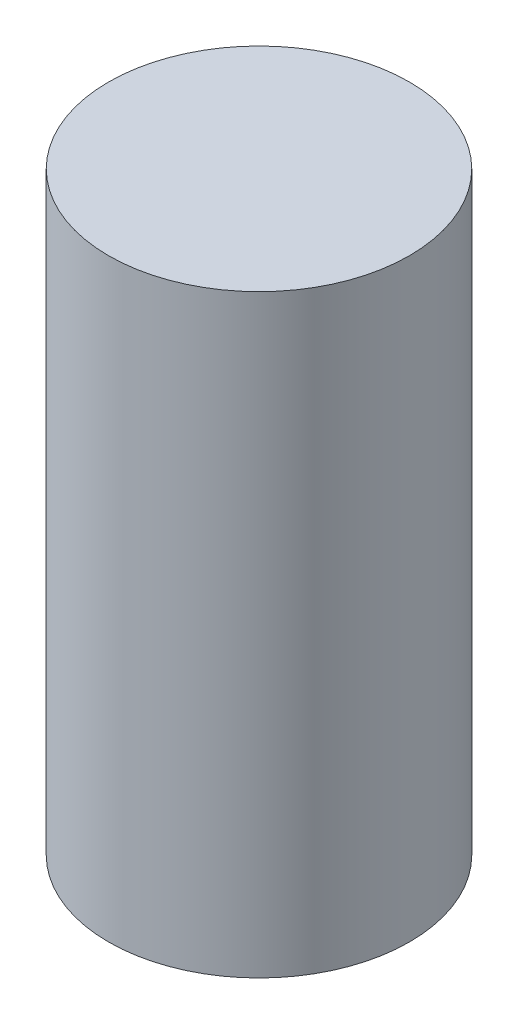
ISO-10303-21;
HEADER;
FILE_DESCRIPTION(('STEP AP214'),'2;1');
FILE_NAME('part.step','',(''),(''),'','','');
FILE_SCHEMA(('AUTOMOTIVE_DESIGN { 1 0 10303 214 1 1 1 1 }'));
ENDSEC;
DATA;
#1=APPLICATION_CONTEXT('core data for automotive mechanical design processes');
#2=APPLICATION_PROTOCOL_DEFINITION('international standard','automotive_design',2000,#1);
#3=PRODUCT_CONTEXT('',#1,'mechanical');
#4=PRODUCT('Part','Part','',(#3));
#5=PRODUCT_RELATED_PRODUCT_CATEGORY('part','',(#4));
#6=PRODUCT_DEFINITION_FORMATION('','',#4);
#7=PRODUCT_DEFINITION_CONTEXT('part definition',#1,'design');
#8=PRODUCT_DEFINITION('design','',#6,#7);
#9=PRODUCT_DEFINITION_SHAPE('','',#8);
#10=(LENGTH_UNIT() NAMED_UNIT(*) SI_UNIT(.MILLI.,.METRE.));
#11=(NAMED_UNIT(*) PLANE_ANGLE_UNIT() SI_UNIT($,.RADIAN.));
#12=(NAMED_UNIT(*) SI_UNIT($,.STERADIAN.) SOLID_ANGLE_UNIT());
#13=UNCERTAINTY_MEASURE_WITH_UNIT(LENGTH_MEASURE(1.E-05),#10,'distance_accuracy_value','');
#14=(GEOMETRIC_REPRESENTATION_CONTEXT(3) GLOBAL_UNCERTAINTY_ASSIGNED_CONTEXT((#13)) GLOBAL_UNIT_ASSIGNED_CONTEXT((#10,
#11,#12)) REPRESENTATION_CONTEXT('',''));
#15=CARTESIAN_POINT('',(0.,0.,0.));
#16=DIRECTION('',(0.,0.,1.));
#17=DIRECTION('',(1.,0.,0.));
#18=AXIS2_PLACEMENT_3D('',#15,#16,#17);
#19=CARTESIAN_POINT('',(0.,0.,0.));
#20=DIRECTION('',(0.,1.,0.));
#21=DIRECTION('',(0.,0.,1.));
#22=AXIS2_PLACEMENT_3D('',#19,#20,#21);
#23=PLANE('',#22);
#24=CARTESIAN_POINT('',(0.,0.,0.));
#25=DIRECTION('',(0.,1.,0.));
#26=DIRECTION('',(0.,0.,1.));
#27=AXIS2_PLACEMENT_3D('',#24,#25,#26);
#28=CIRCLE('',#27,10.125);
#29=CARTESIAN_POINT('',(0.,0.,10.125));
#30=VERTEX_POINT('',#29);
#31=EDGE_CURVE('E11',#30,#30,#28,.T.);
#32=ORIENTED_EDGE('',*,*,#31,.F.);
#33=EDGE_LOOP('',(#32));
#34=FACE_BOUND('',#33,.T.);
#35=CARTESIAN_POINT('',(7.98186747154658,0.,0.));
#36=DIRECTION('',(0.,1.,0.));
#37=DIRECTION('',(0.,0.,1.));
#38=AXIS2_PLACEMENT_3D('',#35,#36,#37);
#39=CIRCLE('',#38,1.5875);
#40=CARTESIAN_POINT('',(9.35668280005437,0.,0.793750000000004));
#41=VERTEX_POINT('',#40);
#42=CARTESIAN_POINT('',(9.35668280005438,0.,-0.793749999999998));
#43=VERTEX_POINT('',#42);
#44=EDGE_CURVE('E52',#41,#43,#39,.T.);
#45=ORIENTED_EDGE('',*,*,#44,.T.);
#46=DIRECTION('',(-0.499999999999999,0.,-0.866025403784439));
#47=VECTOR('',#46,1.);
#48=CARTESIAN_POINT('',(9.35668280005438,0.,-0.793749999999998));
#49=LINE('',#48,#47);
#50=CARTESIAN_POINT('',(5.36574906428109,0.,-7.70625));
#51=VERTEX_POINT('',#50);
#52=EDGE_CURVE('E161',#43,#51,#49,.T.);
#53=ORIENTED_EDGE('',*,*,#52,.T.);
#54=CARTESIAN_POINT('',(3.99093373577329,0.,-6.91250000000001));
#55=DIRECTION('',(0.,1.,0.));
#56=DIRECTION('',(0.,0.,1.));
#57=AXIS2_PLACEMENT_3D('',#54,#55,#56);
#58=CIRCLE('',#57,1.5875);
#59=CARTESIAN_POINT('',(3.99093373577329,0.,-8.5));
#60=VERTEX_POINT('',#59);
#61=EDGE_CURVE('E164',#51,#60,#58,.T.);
#62=ORIENTED_EDGE('',*,*,#61,.T.);
#63=DIRECTION('',(-1.,0.,0.));
#64=VECTOR('',#63,1.);
#65=CARTESIAN_POINT('',(3.99093373577329,0.,-8.5));
#66=LINE('',#65,#64);
#67=CARTESIAN_POINT('',(-3.99093373577329,0.,-8.50000000000001));
#68=VERTEX_POINT('',#67);
#69=EDGE_CURVE('E172',#60,#68,#66,.T.);
#70=ORIENTED_EDGE('',*,*,#69,.T.);
#71=CARTESIAN_POINT('',(-3.99093373577329,0.,-6.91250000000001));
#72=DIRECTION('',(0.,1.,0.));
#73=DIRECTION('',(0.,0.,1.));
#74=AXIS2_PLACEMENT_3D('',#71,#72,#73);
#75=CIRCLE('',#74,1.5875);
#76=CARTESIAN_POINT('',(-5.36574906428109,0.,-7.70625000000001));
#77=VERTEX_POINT('',#76);
#78=EDGE_CURVE('E175',#68,#77,#75,.T.);
#79=ORIENTED_EDGE('',*,*,#78,.T.);
#80=DIRECTION('',(-0.5,0.,0.866025403784439));
#81=VECTOR('',#80,1.);
#82=CARTESIAN_POINT('',(-5.36574906428109,0.,-7.70625000000001));
#83=LINE('',#82,#81);
#84=CARTESIAN_POINT('',(-9.35668280005438,0.,-0.793750000000002));
#85=VERTEX_POINT('',#84);
#86=EDGE_CURVE('E178',#77,#85,#83,.T.);
#87=ORIENTED_EDGE('',*,*,#86,.T.);
#88=CARTESIAN_POINT('',(-7.98186747154658,0.,0.));
#89=DIRECTION('',(0.,1.,0.));
#90=DIRECTION('',(0.,0.,1.));
#91=AXIS2_PLACEMENT_3D('',#88,#89,#90);
#92=CIRCLE('',#91,1.5875);
#93=CARTESIAN_POINT('',(-9.35668280005438,0.,0.79375));
#94=VERTEX_POINT('',#93);
#95=EDGE_CURVE('E181',#85,#94,#92,.T.);
#96=ORIENTED_EDGE('',*,*,#95,.T.);
#97=DIRECTION('',(0.5,0.,0.866025403784438));
#98=VECTOR('',#97,1.);
#99=CARTESIAN_POINT('',(-9.35668280005438,0.,0.79375));
#100=LINE('',#99,#98);
#101=CARTESIAN_POINT('',(-5.36574906428108,0.,7.70625));
#102=VERTEX_POINT('',#101);
#103=EDGE_CURVE('E129',#94,#102,#100,.T.);
#104=ORIENTED_EDGE('',*,*,#103,.T.);
#105=CARTESIAN_POINT('',(-3.99093373577329,0.,6.9125));
#106=DIRECTION('',(0.,1.,0.));
#107=DIRECTION('',(0.,0.,1.));
#108=AXIS2_PLACEMENT_3D('',#105,#106,#107);
#109=CIRCLE('',#108,1.5875);
#110=CARTESIAN_POINT('',(-3.99093373577329,0.,8.5));
#111=VERTEX_POINT('',#110);
#112=EDGE_CURVE('E127',#102,#111,#109,.T.);
#113=ORIENTED_EDGE('',*,*,#112,.T.);
#114=DIRECTION('',(1.,0.,0.));
#115=VECTOR('',#114,1.);
#116=CARTESIAN_POINT('',(-3.99093373577329,0.,8.5));
#117=LINE('',#116,#115);
#118=CARTESIAN_POINT('',(3.99093373577329,0.,8.5));
#119=VERTEX_POINT('',#118);
#120=EDGE_CURVE('E106',#111,#119,#117,.T.);
#121=ORIENTED_EDGE('',*,*,#120,.T.);
#122=CARTESIAN_POINT('',(3.99093373577329,0.,6.9125));
#123=DIRECTION('',(0.,1.,0.));
#124=DIRECTION('',(0.,0.,1.));
#125=AXIS2_PLACEMENT_3D('',#122,#123,#124);
#126=CIRCLE('',#125,1.5875);
#127=CARTESIAN_POINT('',(5.36574906428109,0.,7.70625));
#128=VERTEX_POINT('',#127);
#129=EDGE_CURVE('E117',#119,#128,#126,.T.);
#130=ORIENTED_EDGE('',*,*,#129,.T.);
#131=DIRECTION('',(0.5,0.,-0.866025403784439));
#132=VECTOR('',#131,1.);
#133=CARTESIAN_POINT('',(5.36574906428109,0.,7.70625));
#134=LINE('',#133,#132);
#135=EDGE_CURVE('E123',#128,#41,#134,.T.);
#136=ORIENTED_EDGE('',*,*,#135,.T.);
#137=EDGE_LOOP('',(#45,#53,#62,#70,#79,#87,#96,#104,#113,#121,#130,#136));
#138=FACE_BOUND('',#137,.T.);
#139=ADVANCED_FACE('F37',(#34,#138),#23,.F.);
#140=CARTESIAN_POINT('',(0.,10.,0.));
#141=DIRECTION('',(0.,-1.,0.));
#142=DIRECTION('',(0.,0.,-1.));
#143=AXIS2_PLACEMENT_3D('',#140,#141,#142);
#144=CYLINDRICAL_SURFACE('',#143,10.125);
#145=ORIENTED_EDGE('',*,*,#31,.T.);
#146=EDGE_LOOP('',(#145));
#147=FACE_BOUND('',#146,.T.);
#148=CARTESIAN_POINT('',(0.,40.,0.));
#149=DIRECTION('',(0.,1.,0.));
#150=DIRECTION('',(0.,0.,1.));
#151=AXIS2_PLACEMENT_3D('',#148,#149,#150);
#152=CIRCLE('',#151,10.125);
#153=CARTESIAN_POINT('',(0.,40.,10.125));
#154=VERTEX_POINT('',#153);
#155=EDGE_CURVE('E162',#154,#154,#152,.T.);
#156=ORIENTED_EDGE('',*,*,#155,.F.);
#157=EDGE_LOOP('',(#156));
#158=FACE_BOUND('',#157,.T.);
#159=ADVANCED_FACE('F39',(#147,#158),#144,.T.);
#160=CARTESIAN_POINT('',(7.98186747154658,10.,0.));
#161=DIRECTION('',(0.,-1.,0.));
#162=DIRECTION('',(0.,0.,-1.));
#163=AXIS2_PLACEMENT_3D('',#160,#161,#162);
#164=CYLINDRICAL_SURFACE('',#163,1.5875);
#165=ORIENTED_EDGE('',*,*,#44,.F.);
#166=DIRECTION('',(0.,-1.,0.));
#167=VECTOR('',#166,1.);
#168=CARTESIAN_POINT('',(9.35668280005437,10.,0.793750000000004));
#169=LINE('',#168,#167);
#170=CARTESIAN_POINT('',(9.35668280005437,10.,0.793750000000004));
#171=VERTEX_POINT('',#170);
#172=EDGE_CURVE('E135',#171,#41,#169,.T.);
#173=ORIENTED_EDGE('',*,*,#172,.F.);
#174=CARTESIAN_POINT('',(7.98186747154658,10.,0.));
#175=DIRECTION('',(0.,1.,0.));
#176=DIRECTION('',(0.,0.,1.));
#177=AXIS2_PLACEMENT_3D('',#174,#175,#176);
#178=CIRCLE('',#177,1.5875);
#179=CARTESIAN_POINT('',(9.35668280005438,10.,-0.793749999999998));
#180=VERTEX_POINT('',#179);
#181=EDGE_CURVE('E134',#171,#180,#178,.T.);
#182=ORIENTED_EDGE('',*,*,#181,.T.);
#183=DIRECTION('',(0.,-1.,0.));
#184=VECTOR('',#183,1.);
#185=CARTESIAN_POINT('',(9.35668280005438,10.,-0.793749999999998));
#186=LINE('',#185,#184);
#187=EDGE_CURVE('E45',#180,#43,#186,.T.);
#188=ORIENTED_EDGE('',*,*,#187,.T.);
#189=EDGE_LOOP('',(#165,#173,#182,#188));
#190=FACE_BOUND('',#189,.T.);
#191=ADVANCED_FACE('F155',(#190),#164,.F.);
#192=CARTESIAN_POINT('',(9.35668280005438,10.,-0.793749999999998));
#193=DIRECTION('',(-0.866025403784439,0.,0.499999999999999));
#194=DIRECTION('',(0.499999999999999,0.,0.866025403784439));
#195=AXIS2_PLACEMENT_3D('',#192,#193,#194);
#196=PLANE('',#195);
#197=ORIENTED_EDGE('',*,*,#52,.F.);
#198=ORIENTED_EDGE('',*,*,#187,.F.);
#199=DIRECTION('',(-0.499999999999999,0.,-0.866025403784439));
#200=VECTOR('',#199,1.);
#201=CARTESIAN_POINT('',(9.35668280005438,10.,-0.793749999999998));
#202=LINE('',#201,#200);
#203=CARTESIAN_POINT('',(5.36574906428109,10.,-7.70625));
#204=VERTEX_POINT('',#203);
#205=EDGE_CURVE('E211',#180,#204,#202,.T.);
#206=ORIENTED_EDGE('',*,*,#205,.T.);
#207=DIRECTION('',(0.,-1.,0.));
#208=VECTOR('',#207,1.);
#209=CARTESIAN_POINT('',(5.36574906428109,10.,-7.70625));
#210=LINE('',#209,#208);
#211=EDGE_CURVE('E152',#204,#51,#210,.T.);
#212=ORIENTED_EDGE('',*,*,#211,.T.);
#213=EDGE_LOOP('',(#197,#198,#206,#212));
#214=FACE_BOUND('',#213,.T.);
#215=ADVANCED_FACE('F256',(#214),#196,.T.);
#216=CARTESIAN_POINT('',(3.99093373577329,10.,-6.91250000000001));
#217=DIRECTION('',(0.,-1.,0.));
#218=DIRECTION('',(0.,0.,-1.));
#219=AXIS2_PLACEMENT_3D('',#216,#217,#218);
#220=CYLINDRICAL_SURFACE('',#219,1.5875);
#221=ORIENTED_EDGE('',*,*,#61,.F.);
#222=ORIENTED_EDGE('',*,*,#211,.F.);
#223=CARTESIAN_POINT('',(3.99093373577329,10.,-6.91250000000001));
#224=DIRECTION('',(0.,1.,0.));
#225=DIRECTION('',(0.,0.,1.));
#226=AXIS2_PLACEMENT_3D('',#223,#224,#225);
#227=CIRCLE('',#226,1.5875);
#228=CARTESIAN_POINT('',(3.99093373577329,10.,-8.5));
#229=VERTEX_POINT('',#228);
#230=EDGE_CURVE('E214',#204,#229,#227,.T.);
#231=ORIENTED_EDGE('',*,*,#230,.T.);
#232=DIRECTION('',(0.,-1.,0.));
#233=VECTOR('',#232,1.);
#234=CARTESIAN_POINT('',(3.99093373577329,10.,-8.5));
#235=LINE('',#234,#233);
#236=EDGE_CURVE('E150',#229,#60,#235,.T.);
#237=ORIENTED_EDGE('',*,*,#236,.T.);
#238=EDGE_LOOP('',(#221,#222,#231,#237));
#239=FACE_BOUND('',#238,.T.);
#240=ADVANCED_FACE('F259',(#239),#220,.F.);
#241=CARTESIAN_POINT('',(3.99093373577329,10.,-8.5));
#242=DIRECTION('',(0.,0.,1.));
#243=DIRECTION('',(1.,0.,0.));
#244=AXIS2_PLACEMENT_3D('',#241,#242,#243);
#245=PLANE('',#244);
#246=ORIENTED_EDGE('',*,*,#69,.F.);
#247=ORIENTED_EDGE('',*,*,#236,.F.);
#248=DIRECTION('',(-1.,0.,0.));
#249=VECTOR('',#248,1.);
#250=CARTESIAN_POINT('',(3.99093373577329,10.,-8.5));
#251=LINE('',#250,#249);
#252=CARTESIAN_POINT('',(-3.99093373577329,10.,-8.50000000000001));
#253=VERTEX_POINT('',#252);
#254=EDGE_CURVE('E61',#229,#253,#251,.T.);
#255=ORIENTED_EDGE('',*,*,#254,.T.);
#256=DIRECTION('',(0.,-1.,0.));
#257=VECTOR('',#256,1.);
#258=CARTESIAN_POINT('',(-3.99093373577329,10.,-8.50000000000001));
#259=LINE('',#258,#257);
#260=EDGE_CURVE('E148',#253,#68,#259,.T.);
#261=ORIENTED_EDGE('',*,*,#260,.T.);
#262=EDGE_LOOP('',(#246,#247,#255,#261));
#263=FACE_BOUND('',#262,.T.);
#264=ADVANCED_FACE('F262',(#263),#245,.T.);
#265=CARTESIAN_POINT('',(-3.99093373577329,10.,-6.91250000000001));
#266=DIRECTION('',(0.,-1.,0.));
#267=DIRECTION('',(0.,0.,-1.));
#268=AXIS2_PLACEMENT_3D('',#265,#266,#267);
#269=CYLINDRICAL_SURFACE('',#268,1.5875);
#270=ORIENTED_EDGE('',*,*,#78,.F.);
#271=ORIENTED_EDGE('',*,*,#260,.F.);
#272=CARTESIAN_POINT('',(-3.99093373577329,10.,-6.91250000000001));
#273=DIRECTION('',(0.,1.,0.));
#274=DIRECTION('',(0.,0.,1.));
#275=AXIS2_PLACEMENT_3D('',#272,#273,#274);
#276=CIRCLE('',#275,1.5875);
#277=CARTESIAN_POINT('',(-5.36574906428109,10.,-7.70625000000001));
#278=VERTEX_POINT('',#277);
#279=EDGE_CURVE('E221',#253,#278,#276,.T.);
#280=ORIENTED_EDGE('',*,*,#279,.T.);
#281=DIRECTION('',(0.,-1.,0.));
#282=VECTOR('',#281,1.);
#283=CARTESIAN_POINT('',(-5.36574906428109,10.,-7.70625000000001));
#284=LINE('',#283,#282);
#285=EDGE_CURVE('E146',#278,#77,#284,.T.);
#286=ORIENTED_EDGE('',*,*,#285,.T.);
#287=EDGE_LOOP('',(#270,#271,#280,#286));
#288=FACE_BOUND('',#287,.T.);
#289=ADVANCED_FACE('F266',(#288),#269,.F.);
#290=CARTESIAN_POINT('',(-5.36574906428109,10.,-7.70625000000001));
#291=DIRECTION('',(0.866025403784439,0.,0.5));
#292=DIRECTION('',(0.5,0.,-0.866025403784439));
#293=AXIS2_PLACEMENT_3D('',#290,#291,#292);
#294=PLANE('',#293);
#295=ORIENTED_EDGE('',*,*,#86,.F.);
#296=ORIENTED_EDGE('',*,*,#285,.F.);
#297=DIRECTION('',(-0.5,0.,0.866025403784439));
#298=VECTOR('',#297,1.);
#299=CARTESIAN_POINT('',(-5.36574906428109,10.,-7.70625000000001));
#300=LINE('',#299,#298);
#301=CARTESIAN_POINT('',(-9.35668280005438,10.,-0.793750000000002));
#302=VERTEX_POINT('',#301);
#303=EDGE_CURVE('E224',#278,#302,#300,.T.);
#304=ORIENTED_EDGE('',*,*,#303,.T.);
#305=DIRECTION('',(0.,-1.,0.));
#306=VECTOR('',#305,1.);
#307=CARTESIAN_POINT('',(-9.35668280005438,10.,-0.793750000000002));
#308=LINE('',#307,#306);
#309=EDGE_CURVE('E144',#302,#85,#308,.T.);
#310=ORIENTED_EDGE('',*,*,#309,.T.);
#311=EDGE_LOOP('',(#295,#296,#304,#310));
#312=FACE_BOUND('',#311,.T.);
#313=ADVANCED_FACE('F270',(#312),#294,.T.);
#314=CARTESIAN_POINT('',(-7.98186747154658,10.,0.));
#315=DIRECTION('',(0.,-1.,0.));
#316=DIRECTION('',(0.,0.,-1.));
#317=AXIS2_PLACEMENT_3D('',#314,#315,#316);
#318=CYLINDRICAL_SURFACE('',#317,1.5875);
#319=ORIENTED_EDGE('',*,*,#95,.F.);
#320=ORIENTED_EDGE('',*,*,#309,.F.);
#321=CARTESIAN_POINT('',(-7.98186747154658,10.,0.));
#322=DIRECTION('',(0.,1.,0.));
#323=DIRECTION('',(0.,0.,1.));
#324=AXIS2_PLACEMENT_3D('',#321,#322,#323);
#325=CIRCLE('',#324,1.5875);
#326=CARTESIAN_POINT('',(-9.35668280005438,10.,0.79375));
#327=VERTEX_POINT('',#326);
#328=EDGE_CURVE('E227',#302,#327,#325,.T.);
#329=ORIENTED_EDGE('',*,*,#328,.T.);
#330=DIRECTION('',(0.,-1.,0.));
#331=VECTOR('',#330,1.);
#332=CARTESIAN_POINT('',(-9.35668280005438,10.,0.79375));
#333=LINE('',#332,#331);
#334=EDGE_CURVE('E142',#327,#94,#333,.T.);
#335=ORIENTED_EDGE('',*,*,#334,.T.);
#336=EDGE_LOOP('',(#319,#320,#329,#335));
#337=FACE_BOUND('',#336,.T.);
#338=ADVANCED_FACE('F274',(#337),#318,.F.);
#339=CARTESIAN_POINT('',(-9.35668280005438,10.,0.79375));
#340=DIRECTION('',(0.866025403784438,0.,-0.5));
#341=DIRECTION('',(-0.5,0.,-0.866025403784438));
#342=AXIS2_PLACEMENT_3D('',#339,#340,#341);
#343=PLANE('',#342);
#344=ORIENTED_EDGE('',*,*,#103,.F.);
#345=ORIENTED_EDGE('',*,*,#334,.F.);
#346=DIRECTION('',(0.5,0.,0.866025403784438));
#347=VECTOR('',#346,1.);
#348=CARTESIAN_POINT('',(-9.35668280005438,10.,0.79375));
#349=LINE('',#348,#347);
#350=CARTESIAN_POINT('',(-5.36574906428108,10.,7.70625));
#351=VERTEX_POINT('',#350);
#352=EDGE_CURVE('E193',#327,#351,#349,.T.);
#353=ORIENTED_EDGE('',*,*,#352,.T.);
#354=DIRECTION('',(0.,-1.,0.));
#355=VECTOR('',#354,1.);
#356=CARTESIAN_POINT('',(-5.36574906428108,10.,7.70625));
#357=LINE('',#356,#355);
#358=EDGE_CURVE('E140',#351,#102,#357,.T.);
#359=ORIENTED_EDGE('',*,*,#358,.T.);
#360=EDGE_LOOP('',(#344,#345,#353,#359));
#361=FACE_BOUND('',#360,.T.);
#362=ADVANCED_FACE('F187',(#361),#343,.T.);
#363=CARTESIAN_POINT('',(-3.99093373577329,10.,6.9125));
#364=DIRECTION('',(0.,-1.,0.));
#365=DIRECTION('',(0.,0.,-1.));
#366=AXIS2_PLACEMENT_3D('',#363,#364,#365);
#367=CYLINDRICAL_SURFACE('',#366,1.5875);
#368=ORIENTED_EDGE('',*,*,#112,.F.);
#369=ORIENTED_EDGE('',*,*,#358,.F.);
#370=CARTESIAN_POINT('',(-3.99093373577329,10.,6.9125));
#371=DIRECTION('',(0.,1.,0.));
#372=DIRECTION('',(0.,0.,1.));
#373=AXIS2_PLACEMENT_3D('',#370,#371,#372);
#374=CIRCLE('',#373,1.5875);
#375=CARTESIAN_POINT('',(-3.99093373577329,10.,8.5));
#376=VERTEX_POINT('',#375);
#377=EDGE_CURVE('E199',#351,#376,#374,.T.);
#378=ORIENTED_EDGE('',*,*,#377,.T.);
#379=DIRECTION('',(0.,-1.,0.));
#380=VECTOR('',#379,1.);
#381=CARTESIAN_POINT('',(-3.99093373577329,10.,8.5));
#382=LINE('',#381,#380);
#383=EDGE_CURVE('E113',#376,#111,#382,.T.);
#384=ORIENTED_EDGE('',*,*,#383,.T.);
#385=EDGE_LOOP('',(#368,#369,#378,#384));
#386=FACE_BOUND('',#385,.T.);
#387=ADVANCED_FACE('F196',(#386),#367,.F.);
#388=CARTESIAN_POINT('',(-3.99093373577329,10.,8.5));
#389=DIRECTION('',(0.,0.,-1.));
#390=DIRECTION('',(-1.,0.,0.));
#391=AXIS2_PLACEMENT_3D('',#388,#389,#390);
#392=PLANE('',#391);
#393=ORIENTED_EDGE('',*,*,#120,.F.);
#394=ORIENTED_EDGE('',*,*,#383,.F.);
#395=DIRECTION('',(1.,0.,0.));
#396=VECTOR('',#395,1.);
#397=CARTESIAN_POINT('',(-3.99093373577329,10.,8.5));
#398=LINE('',#397,#396);
#399=CARTESIAN_POINT('',(3.99093373577329,10.,8.5));
#400=VERTEX_POINT('',#399);
#401=EDGE_CURVE('E110',#376,#400,#398,.T.);
#402=ORIENTED_EDGE('',*,*,#401,.T.);
#403=DIRECTION('',(0.,-1.,0.));
#404=VECTOR('',#403,1.);
#405=CARTESIAN_POINT('',(3.99093373577329,10.,8.5));
#406=LINE('',#405,#404);
#407=EDGE_CURVE('E101',#400,#119,#406,.T.);
#408=ORIENTED_EDGE('',*,*,#407,.T.);
#409=EDGE_LOOP('',(#393,#394,#402,#408));
#410=FACE_BOUND('',#409,.T.);
#411=ADVANCED_FACE('F103',(#410),#392,.T.);
#412=CARTESIAN_POINT('',(3.99093373577329,10.,6.9125));
#413=DIRECTION('',(0.,-1.,0.));
#414=DIRECTION('',(0.,0.,-1.));
#415=AXIS2_PLACEMENT_3D('',#412,#413,#414);
#416=CYLINDRICAL_SURFACE('',#415,1.5875);
#417=ORIENTED_EDGE('',*,*,#129,.F.);
#418=ORIENTED_EDGE('',*,*,#407,.F.);
#419=CARTESIAN_POINT('',(3.99093373577329,10.,6.9125));
#420=DIRECTION('',(0.,1.,0.));
#421=DIRECTION('',(0.,0.,1.));
#422=AXIS2_PLACEMENT_3D('',#419,#420,#421);
#423=CIRCLE('',#422,1.5875);
#424=CARTESIAN_POINT('',(5.36574906428109,10.,7.70625));
#425=VERTEX_POINT('',#424);
#426=EDGE_CURVE('E232',#400,#425,#423,.T.);
#427=ORIENTED_EDGE('',*,*,#426,.T.);
#428=DIRECTION('',(0.,-1.,0.));
#429=VECTOR('',#428,1.);
#430=CARTESIAN_POINT('',(5.36574906428109,10.,7.70625));
#431=LINE('',#430,#429);
#432=EDGE_CURVE('E114',#425,#128,#431,.T.);
#433=ORIENTED_EDGE('',*,*,#432,.T.);
#434=EDGE_LOOP('',(#417,#418,#427,#433));
#435=FACE_BOUND('',#434,.T.);
#436=ADVANCED_FACE('F118',(#435),#416,.F.);
#437=CARTESIAN_POINT('',(5.36574906428109,10.,7.70625));
#438=DIRECTION('',(-0.866025403784439,0.,-0.5));
#439=DIRECTION('',(-0.5,0.,0.866025403784439));
#440=AXIS2_PLACEMENT_3D('',#437,#438,#439);
#441=PLANE('',#440);
#442=ORIENTED_EDGE('',*,*,#135,.F.);
#443=ORIENTED_EDGE('',*,*,#432,.F.);
#444=DIRECTION('',(0.5,0.,-0.866025403784439));
#445=VECTOR('',#444,1.);
#446=CARTESIAN_POINT('',(5.36574906428109,10.,7.70625));
#447=LINE('',#446,#445);
#448=EDGE_CURVE('E137',#425,#171,#447,.T.);
#449=ORIENTED_EDGE('',*,*,#448,.T.);
#450=ORIENTED_EDGE('',*,*,#172,.T.);
#451=EDGE_LOOP('',(#442,#443,#449,#450));
#452=FACE_BOUND('',#451,.T.);
#453=ADVANCED_FACE('F234',(#452),#441,.T.);
#454=CARTESIAN_POINT('',(0.,10.,0.));
#455=DIRECTION('',(0.,1.,0.));
#456=DIRECTION('',(0.,0.,1.));
#457=AXIS2_PLACEMENT_3D('',#454,#455,#456);
#458=PLANE('',#457);
#459=ORIENTED_EDGE('',*,*,#205,.F.);
#460=ORIENTED_EDGE('',*,*,#181,.F.);
#461=ORIENTED_EDGE('',*,*,#448,.F.);
#462=ORIENTED_EDGE('',*,*,#426,.F.);
#463=ORIENTED_EDGE('',*,*,#401,.F.);
#464=ORIENTED_EDGE('',*,*,#377,.F.);
#465=ORIENTED_EDGE('',*,*,#352,.F.);
#466=ORIENTED_EDGE('',*,*,#328,.F.);
#467=ORIENTED_EDGE('',*,*,#303,.F.);
#468=ORIENTED_EDGE('',*,*,#279,.F.);
#469=ORIENTED_EDGE('',*,*,#254,.F.);
#470=ORIENTED_EDGE('',*,*,#230,.F.);
#471=EDGE_LOOP('',(#459,#460,#461,#462,#463,#464,#465,#466,#467,#468,#469,#470));
#472=FACE_BOUND('',#471,.T.);
#473=ADVANCED_FACE('F212',(#472),#458,.F.);
#474=CARTESIAN_POINT('',(0.,40.,0.));
#475=DIRECTION('',(0.,1.,0.));
#476=DIRECTION('',(0.,0.,1.));
#477=AXIS2_PLACEMENT_3D('',#474,#475,#476);
#478=PLANE('',#477);
#479=ORIENTED_EDGE('',*,*,#155,.T.);
#480=EDGE_LOOP('',(#479));
#481=FACE_BOUND('',#480,.T.);
#482=ADVANCED_FACE('F242',(#481),#478,.T.);
#483=CLOSED_SHELL('',(#139,#159,#191,#215,#240,#264,#289,#313,#338,#362,#387,#411,#436,#453,
#473,#482));
#484=MANIFOLD_SOLID_BREP('B2',#483);
#485=ADVANCED_BREP_SHAPE_REPRESENTATION('',(#18,#484),#14);
#486=SHAPE_DEFINITION_REPRESENTATION(#9,#485);
ENDSEC;
END-ISO-10303-21;
